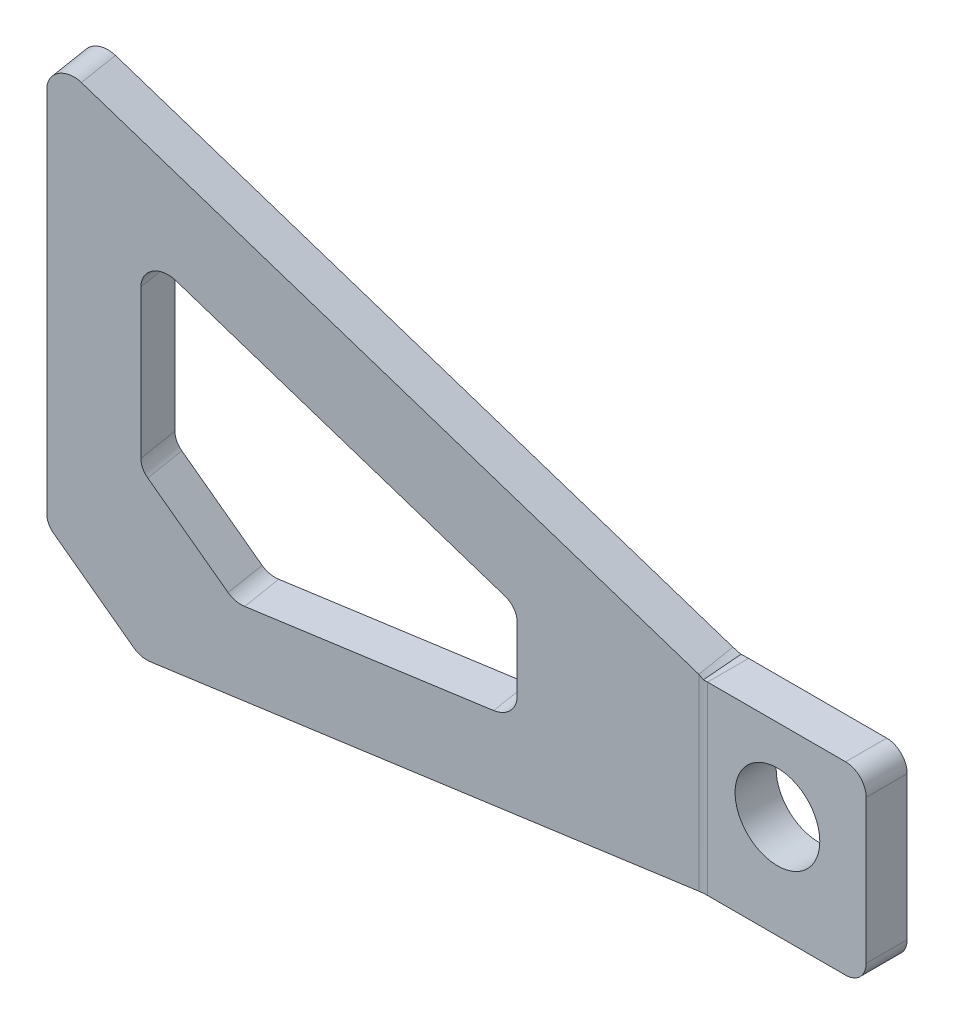
ISO-10303-21;
HEADER;
FILE_DESCRIPTION(('STEP AP214'),'2;1');
FILE_NAME('part.step','',(''),(''),'','','');
FILE_SCHEMA(('AUTOMOTIVE_DESIGN { 1 0 10303 214 1 1 1 1 }'));
ENDSEC;
DATA;
#1=APPLICATION_CONTEXT('core data for automotive mechanical design processes');
#2=APPLICATION_PROTOCOL_DEFINITION('international standard','automotive_design',2000,#1);
#3=PRODUCT_CONTEXT('',#1,'mechanical');
#4=PRODUCT('Part','Part','',(#3));
#5=PRODUCT_RELATED_PRODUCT_CATEGORY('part','',(#4));
#6=PRODUCT_DEFINITION_FORMATION('','',#4);
#7=PRODUCT_DEFINITION_CONTEXT('part definition',#1,'design');
#8=PRODUCT_DEFINITION('design','',#6,#7);
#9=PRODUCT_DEFINITION_SHAPE('','',#8);
#10=(LENGTH_UNIT() NAMED_UNIT(*) SI_UNIT(.MILLI.,.METRE.));
#11=(NAMED_UNIT(*) PLANE_ANGLE_UNIT() SI_UNIT($,.RADIAN.));
#12=(NAMED_UNIT(*) SI_UNIT($,.STERADIAN.) SOLID_ANGLE_UNIT());
#13=UNCERTAINTY_MEASURE_WITH_UNIT(LENGTH_MEASURE(1.E-05),#10,'distance_accuracy_value','');
#14=(GEOMETRIC_REPRESENTATION_CONTEXT(3) GLOBAL_UNCERTAINTY_ASSIGNED_CONTEXT((#13)) GLOBAL_UNIT_ASSIGNED_CONTEXT((#10,
#11,#12)) REPRESENTATION_CONTEXT('',''));
#15=CARTESIAN_POINT('',(0.,0.,0.));
#16=DIRECTION('',(0.,0.,1.));
#17=DIRECTION('',(1.,0.,0.));
#18=AXIS2_PLACEMENT_3D('',#15,#16,#17);
#19=CARTESIAN_POINT('',(0.609276448916205,76.2,7.71968790551372));
#20=DIRECTION('',(0.466303984354861,0.881479970028782,-0.0745228596662755));
#21=DIRECTION('',(-0.870434104129073,0.472221412515419,0.139109338043714));
#22=AXIS2_PLACEMENT_3D('',#19,#20,#21);
#23=PLANE('',#22);
#24=DIRECTION('',(-0.870434104129073,0.472221412515419,0.139109338043714));
#25=VECTOR('',#24,1.);
#26=CARTESIAN_POINT('',(0.609276448916205,76.2,7.71968790551372));
#27=LINE('',#26,#25);
#28=CARTESIAN_POINT('',(87.5247750487067,29.0472525104682,-6.17080353846967));
#29=VERTEX_POINT('',#28);
#30=CARTESIAN_POINT('',(5.22500552874326,73.6959091153198,6.9820203281084));
#31=VERTEX_POINT('',#30);
#32=EDGE_CURVE('E256',#29,#31,#27,.T.);
#33=ORIENTED_EDGE('',*,*,#32,.T.);
#34=DIRECTION('',(0.157813385185794,0.,0.987468954173345));
#35=VECTOR('',#34,1.);
#36=CARTESIAN_POINT('',(5.22500552874326,73.6959091153198,6.9820203281084));
#37=LINE('',#36,#35);
#38=CARTESIAN_POINT('',(6.22712052467305,73.6959091153198,13.2524481871091));
#39=VERTEX_POINT('',#38);
#40=EDGE_CURVE('E398',#31,#39,#37,.T.);
#41=ORIENTED_EDGE('',*,*,#40,.T.);
#42=DIRECTION('',(-0.870434104129073,0.472221412515419,0.139109338043714));
#43=VECTOR('',#42,1.);
#44=CARTESIAN_POINT('',(1.611391444846,76.2,13.9901157645145));
#45=LINE('',#44,#43);
#46=CARTESIAN_POINT('',(88.5268900446365,29.0472525104682,0.0996243205310717));
#47=VERTEX_POINT('',#46);
#48=EDGE_CURVE('E271',#47,#39,#45,.T.);
#49=ORIENTED_EDGE('',*,*,#48,.F.);
#50=CARTESIAN_POINT('',(87.5247750487067,29.0472525104682,-6.17080353846967));
#51=CARTESIAN_POINT('',(88.5268900446365,29.0472525104682,0.0996243205310717));
#52=B_SPLINE_CURVE_WITH_KNOTS('',1,(#50,#51),.UNSPECIFIED.,.F.,.F.,(2,2),(0.,1.),.UNSPECIFIED.);
#53=EDGE_CURVE('E238',#47,#29,#52,.F.);
#54=ORIENTED_EDGE('',*,*,#53,.T.);
#55=EDGE_LOOP('',(#33,#41,#49,#54));
#56=FACE_BOUND('',#55,.T.);
#57=ADVANCED_FACE('F55',(#56),#23,.T.);
#58=CARTESIAN_POINT('',(113.47697791093,0.,-10.3183820212225));
#59=DIRECTION('',(0.,-1.,0.));
#60=DIRECTION('',(0.987468954173345,0.,-0.157813385185794));
#61=AXIS2_PLACEMENT_3D('',#58,#59,#60);
#62=PLANE('',#61);
#63=DIRECTION('',(0.987468954173345,0.,-0.157813385185794));
#64=VECTOR('',#63,1.);
#65=CARTESIAN_POINT('',(114.479092906859,0.,-4.04795416222179));
#66=LINE('',#65,#64);
#67=CARTESIAN_POINT('',(15.4508952933876,0.,11.7783409614691));
#68=VERTEX_POINT('',#67);
#69=CARTESIAN_POINT('',(88.5268900446365,0.,0.0996243205310717));
#70=VERTEX_POINT('',#69);
#71=EDGE_CURVE('E266',#68,#70,#66,.T.);
#72=ORIENTED_EDGE('',*,*,#71,.F.);
#73=DIRECTION('',(0.157813385185794,0.,0.987468954173345));
#74=VECTOR('',#73,1.);
#75=CARTESIAN_POINT('',(14.4487802974578,0.,5.50791310246833));
#76=LINE('',#75,#74);
#77=CARTESIAN_POINT('',(14.4487802974578,0.,5.50791310246834));
#78=VERTEX_POINT('',#77);
#79=EDGE_CURVE('E416',#68,#78,#76,.F.);
#80=ORIENTED_EDGE('',*,*,#79,.T.);
#81=DIRECTION('',(0.987468954173345,0.,-0.157813385185794));
#82=VECTOR('',#81,1.);
#83=CARTESIAN_POINT('',(113.47697791093,0.,-10.3183820212225));
#84=LINE('',#83,#82);
#85=CARTESIAN_POINT('',(87.5247750487067,0.,-6.17080353846967));
#86=VERTEX_POINT('',#85);
#87=EDGE_CURVE('E239',#78,#86,#84,.T.);
#88=ORIENTED_EDGE('',*,*,#87,.T.);
#89=DIRECTION('',(0.157813385185794,0.,0.987468954173345));
#90=VECTOR('',#89,1.);
#91=CARTESIAN_POINT('',(87.5247750487067,0.,-6.17080353846967));
#92=LINE('',#91,#90);
#93=EDGE_CURVE('E449',#86,#70,#92,.T.);
#94=ORIENTED_EDGE('',*,*,#93,.T.);
#95=EDGE_LOOP('',(#72,#80,#88,#94));
#96=FACE_BOUND('',#95,.T.);
#97=ADVANCED_FACE('F291',(#96),#62,.T.);
#98=CARTESIAN_POINT('',(0.609276448916205,0.,7.71968790551372));
#99=DIRECTION('',(-0.157813385185794,0.,-0.987468954173345));
#100=DIRECTION('',(-0.987468954173345,0.,0.157813385185794));
#101=AXIS2_PLACEMENT_3D('',#98,#99,#100);
#102=PLANE('',#101);
#103=DIRECTION('',(-0.870434104129073,0.472221412515419,0.139109338043714));
#104=VECTOR('',#103,1.);
#105=CARTESIAN_POINT('',(13.1501321669177,54.9888408419135,5.71545791365413));
#106=LINE('',#105,#104);
#107=CARTESIAN_POINT('',(61.6588562597499,28.6722499572333,-2.03701463525973));
#108=VERTEX_POINT('',#107);
#109=CARTESIAN_POINT('',(17.7658612467447,52.4847499572332,4.97779033624881));
#110=VERTEX_POINT('',#109);
#111=EDGE_CURVE('E471',#108,#110,#106,.T.);
#112=ORIENTED_EDGE('',*,*,#111,.T.);
#113=CARTESIAN_POINT('',(16.2853460964181,49.6860510523919,5.21440041568924));
#114=DIRECTION('',(-0.157813385185794,0.,-0.987468954173345));
#115=DIRECTION('',(-0.987468954173345,0.,0.157813385185794));
#116=AXIS2_PLACEMENT_3D('',#113,#114,#115);
#117=CIRCLE('',#116,3.175);
#118=CARTESIAN_POINT('',(13.1501321669177,49.6860510523919,5.71545791365413));
#119=VERTEX_POINT('',#118);
#120=EDGE_CURVE('E362',#110,#119,#117,.F.);
#121=ORIENTED_EDGE('',*,*,#120,.T.);
#122=DIRECTION('',(0.,-1.,0.));
#123=VECTOR('',#122,1.);
#124=CARTESIAN_POINT('',(13.1501321669177,12.7,5.71545791365413));
#125=LINE('',#124,#123);
#126=CARTESIAN_POINT('',(13.1501321669177,26.7151280605345,5.71545791365413));
#127=VERTEX_POINT('',#126);
#128=EDGE_CURVE('E469',#119,#127,#125,.T.);
#129=ORIENTED_EDGE('',*,*,#128,.T.);
#130=CARTESIAN_POINT('',(16.2853460964181,26.7151280605345,5.21440041568924));
#131=DIRECTION('',(-0.157813385185794,0.,-0.987468954173345));
#132=DIRECTION('',(-0.987468954173345,0.,0.157813385185794));
#133=AXIS2_PLACEMENT_3D('',#130,#131,#132);
#134=CIRCLE('',#133,3.175);
#135=CARTESIAN_POINT('',(14.0684150663978,24.4700640302672,5.56870157026458));
#136=VERTEX_POINT('',#135);
#137=EDGE_CURVE('E360',#127,#136,#134,.F.);
#138=ORIENTED_EDGE('',*,*,#137,.T.);
#139=DIRECTION('',(-0.698245993707164,0.707106781186544,0.11159091482688));
#140=VECTOR('',#139,1.);
#141=CARTESIAN_POINT('',(25.6909878849193,12.7,3.71122792179453));
#142=LINE('',#141,#140);
#143=CARTESIAN_POINT('',(24.7727049854391,13.6299359697327,3.85798426518409));
#144=VERTEX_POINT('',#143);
#145=EDGE_CURVE('E439',#136,#144,#142,.F.);
#146=ORIENTED_EDGE('',*,*,#145,.T.);
#147=CARTESIAN_POINT('',(26.9896360154594,15.875,3.50368311060875));
#148=DIRECTION('',(-0.157813385185794,0.,-0.987468954173345));
#149=DIRECTION('',(-0.987468954173345,0.,0.157813385185794));
#150=AXIS2_PLACEMENT_3D('',#147,#148,#149);
#151=CIRCLE('',#150,3.175);
#152=CARTESIAN_POINT('',(26.9896360154594,12.7,3.50368311060874));
#153=VERTEX_POINT('',#152);
#154=EDGE_CURVE('E12',#144,#153,#151,.F.);
#155=ORIENTED_EDGE('',*,*,#154,.T.);
#156=DIRECTION('',(0.987468954173345,0.,-0.157813385185794));
#157=VECTOR('',#156,1.);
#158=CARTESIAN_POINT('',(63.3135550389236,12.7,-2.3014620537842));
#159=LINE('',#158,#157);
#160=CARTESIAN_POINT('',(60.1783411094232,12.7,-1.8004045558193));
#161=VERTEX_POINT('',#160);
#162=EDGE_CURVE('E491',#153,#161,#159,.T.);
#163=ORIENTED_EDGE('',*,*,#162,.T.);
#164=CARTESIAN_POINT('',(60.1783411094232,15.875,-1.8004045558193));
#165=DIRECTION('',(-0.157813385185794,0.,-0.987468954173345));
#166=DIRECTION('',(-0.987468954173345,0.,0.157813385185794));
#167=AXIS2_PLACEMENT_3D('',#164,#165,#166);
#168=CIRCLE('',#167,3.175);
#169=CARTESIAN_POINT('',(63.3135550389236,15.875,-2.3014620537842));
#170=VERTEX_POINT('',#169);
#171=EDGE_CURVE('E372',#161,#170,#168,.F.);
#172=ORIENTED_EDGE('',*,*,#171,.T.);
#173=DIRECTION('',(0.,1.,0.));
#174=VECTOR('',#173,1.);
#175=CARTESIAN_POINT('',(63.3135550389236,27.7745551276278,-2.3014620537842));
#176=LINE('',#175,#174);
#177=CARTESIAN_POINT('',(63.3135550389236,25.8735510523919,-2.3014620537842));
#178=VERTEX_POINT('',#177);
#179=EDGE_CURVE('E476',#170,#178,#176,.T.);
#180=ORIENTED_EDGE('',*,*,#179,.T.);
#181=CARTESIAN_POINT('',(60.1783411094232,25.8735510523919,-1.8004045558193));
#182=DIRECTION('',(-0.157813385185794,0.,-0.987468954173345));
#183=DIRECTION('',(-0.987468954173345,0.,0.157813385185794));
#184=AXIS2_PLACEMENT_3D('',#181,#182,#183);
#185=CIRCLE('',#184,3.175);
#186=EDGE_CURVE('E368',#178,#108,#185,.F.);
#187=ORIENTED_EDGE('',*,*,#186,.T.);
#188=EDGE_LOOP('',(#112,#121,#129,#138,#146,#155,#163,#172,#180,#187));
#189=FACE_BOUND('',#188,.T.);
#190=DIRECTION('',(0.698245993707162,-0.707106781186547,-0.11159091482688));
#191=VECTOR('',#190,1.);
#192=CARTESIAN_POINT('',(6.87970430791694,6.35000000000001,6.71757290958393));
#193=LINE('',#192,#191);
#194=CARTESIAN_POINT('',(12.2318492674376,0.929935969732703,5.86221425704368));
#195=VERTEX_POINT('',#194);
#196=CARTESIAN_POINT('',(1.52755934839634,11.7700640302673,7.57293156212416));
#197=VERTEX_POINT('',#196);
#198=EDGE_CURVE('E444',#195,#197,#193,.F.);
#199=ORIENTED_EDGE('',*,*,#198,.T.);
#200=CARTESIAN_POINT('',(3.74449037841658,14.0151280605346,7.21863040754882));
#201=DIRECTION('',(-0.157813385185794,0.,-0.987468954173345));
#202=DIRECTION('',(-0.987468954173345,0.,0.157813385185794));
#203=AXIS2_PLACEMENT_3D('',#200,#201,#202);
#204=CIRCLE('',#203,3.175);
#205=CARTESIAN_POINT('',(0.609276448916205,14.0151280605346,7.71968790551372));
#206=VERTEX_POINT('',#205);
#207=EDGE_CURVE('E419',#197,#206,#204,.T.);
#208=ORIENTED_EDGE('',*,*,#207,.T.);
#209=DIRECTION('',(0.,-1.,0.));
#210=VECTOR('',#209,1.);
#211=CARTESIAN_POINT('',(0.609276448916205,0.,7.71968790551372));
#212=LINE('',#211,#210);
#213=CARTESIAN_POINT('',(0.609276448916205,70.8972102104783,7.71968790551372));
#214=VERTEX_POINT('',#213);
#215=EDGE_CURVE('E265',#214,#206,#212,.T.);
#216=ORIENTED_EDGE('',*,*,#215,.F.);
#217=CARTESIAN_POINT('',(3.74449037841658,70.8972102104784,7.21863040754882));
#218=DIRECTION('',(-0.157813385185794,0.,-0.987468954173345));
#219=DIRECTION('',(-0.987468954173345,0.,0.157813385185794));
#220=AXIS2_PLACEMENT_3D('',#217,#218,#219);
#221=CIRCLE('',#220,3.175);
#222=EDGE_CURVE('E261',#214,#31,#221,.T.);
#223=ORIENTED_EDGE('',*,*,#222,.T.);
#224=ORIENTED_EDGE('',*,*,#32,.F.);
#225=DIRECTION('',(0.,-1.,0.));
#226=VECTOR('',#225,1.);
#227=CARTESIAN_POINT('',(87.5247750487067,0.,-6.17080353846967));
#228=LINE('',#227,#226);
#229=EDGE_CURVE('E224',#29,#86,#228,.T.);
#230=ORIENTED_EDGE('',*,*,#229,.T.);
#231=ORIENTED_EDGE('',*,*,#87,.F.);
#232=CARTESIAN_POINT('',(14.4487802974578,3.175,5.50791310246834));
#233=DIRECTION('',(-0.157813385185794,0.,-0.987468954173345));
#234=DIRECTION('',(-0.987468954173345,0.,0.157813385185794));
#235=AXIS2_PLACEMENT_3D('',#232,#233,#234);
#236=CIRCLE('',#235,3.175);
#237=EDGE_CURVE('E421',#78,#195,#236,.T.);
#238=ORIENTED_EDGE('',*,*,#237,.T.);
#239=EDGE_LOOP('',(#199,#208,#216,#223,#224,#230,#231,#238));
#240=FACE_BOUND('',#239,.T.);
#241=ADVANCED_FACE('F258',(#189,#240),#102,.T.);
#242=CARTESIAN_POINT('',(0.609276448916205,0.,7.71968790551372));
#243=DIRECTION('',(-0.987468954173345,0.,0.157813385185794));
#244=DIRECTION('',(0.157813385185794,0.,0.987468954173345));
#245=AXIS2_PLACEMENT_3D('',#242,#243,#244);
#246=PLANE('',#245);
#247=ORIENTED_EDGE('',*,*,#215,.T.);
#248=DIRECTION('',(-0.157813385185794,0.,-0.987468954173345));
#249=VECTOR('',#248,1.);
#250=CARTESIAN_POINT('',(0.609276448916205,14.0151280605346,7.71968790551372));
#251=LINE('',#250,#249);
#252=CARTESIAN_POINT('',(1.611391444846,14.0151280605346,13.9901157645145));
#253=VERTEX_POINT('',#252);
#254=EDGE_CURVE('E434',#206,#253,#251,.F.);
#255=ORIENTED_EDGE('',*,*,#254,.T.);
#256=DIRECTION('',(0.,-1.,0.));
#257=VECTOR('',#256,1.);
#258=CARTESIAN_POINT('',(1.611391444846,0.,13.9901157645145));
#259=LINE('',#258,#257);
#260=CARTESIAN_POINT('',(1.611391444846,70.8972102104783,13.9901157645145));
#261=VERTEX_POINT('',#260);
#262=EDGE_CURVE('E462',#261,#253,#259,.T.);
#263=ORIENTED_EDGE('',*,*,#262,.F.);
#264=DIRECTION('',(0.157813385185794,0.,0.987468954173345));
#265=VECTOR('',#264,1.);
#266=CARTESIAN_POINT('',(0.609276448916205,70.8972102104784,7.71968790551372));
#267=LINE('',#266,#265);
#268=EDGE_CURVE('E437',#261,#214,#267,.F.);
#269=ORIENTED_EDGE('',*,*,#268,.T.);
#270=EDGE_LOOP('',(#247,#255,#263,#269));
#271=FACE_BOUND('',#270,.T.);
#272=ADVANCED_FACE('F297',(#271),#246,.T.);
#273=CARTESIAN_POINT('',(1.611391444846,0.,13.9901157645145));
#274=DIRECTION('',(-0.157813385185794,0.,-0.987468954173345));
#275=DIRECTION('',(-0.987468954173345,0.,0.157813385185794));
#276=AXIS2_PLACEMENT_3D('',#273,#274,#275);
#277=PLANE('',#276);
#278=ORIENTED_EDGE('',*,*,#262,.T.);
#279=CARTESIAN_POINT('',(4.74660537434637,14.0151280605346,13.4890582665496));
#280=DIRECTION('',(-0.157813385185794,0.,-0.987468954173345));
#281=DIRECTION('',(-0.987468954173345,0.,0.157813385185794));
#282=AXIS2_PLACEMENT_3D('',#279,#280,#281);
#283=CIRCLE('',#282,3.175);
#284=CARTESIAN_POINT('',(2.52967434432613,11.7700640302673,13.8433594211249));
#285=VERTEX_POINT('',#284);
#286=EDGE_CURVE('E428',#253,#285,#283,.F.);
#287=ORIENTED_EDGE('',*,*,#286,.T.);
#288=DIRECTION('',(-0.698245993707162,0.707106781186547,0.11159091482688));
#289=VECTOR('',#288,1.);
#290=CARTESIAN_POINT('',(1.611391444846,12.7,13.9901157645145));
#291=LINE('',#290,#289);
#292=CARTESIAN_POINT('',(13.2339642633674,0.929935969732702,12.1326421160444));
#293=VERTEX_POINT('',#292);
#294=EDGE_CURVE('E446',#285,#293,#291,.F.);
#295=ORIENTED_EDGE('',*,*,#294,.T.);
#296=CARTESIAN_POINT('',(15.4508952933876,3.175,11.7783409614691));
#297=DIRECTION('',(-0.157813385185794,0.,-0.987468954173345));
#298=DIRECTION('',(-0.987468954173345,0.,0.157813385185794));
#299=AXIS2_PLACEMENT_3D('',#296,#297,#298);
#300=CIRCLE('',#299,3.175);
#301=EDGE_CURVE('E430',#293,#68,#300,.F.);
#302=ORIENTED_EDGE('',*,*,#301,.T.);
#303=ORIENTED_EDGE('',*,*,#71,.T.);
#304=DIRECTION('',(0.,-1.,0.));
#305=VECTOR('',#304,1.);
#306=CARTESIAN_POINT('',(88.5268900446365,0.,0.0996243205310682));
#307=LINE('',#306,#305);
#308=EDGE_CURVE('E273',#47,#70,#307,.T.);
#309=ORIENTED_EDGE('',*,*,#308,.F.);
#310=ORIENTED_EDGE('',*,*,#48,.T.);
#311=CARTESIAN_POINT('',(4.74660537434637,70.8972102104784,13.4890582665496));
#312=DIRECTION('',(-0.157813385185794,0.,-0.987468954173345));
#313=DIRECTION('',(-0.987468954173345,0.,0.157813385185794));
#314=AXIS2_PLACEMENT_3D('',#311,#312,#313);
#315=CIRCLE('',#314,3.175);
#316=EDGE_CURVE('E432',#39,#261,#315,.F.);
#317=ORIENTED_EDGE('',*,*,#316,.T.);
#318=EDGE_LOOP('',(#278,#287,#295,#302,#303,#309,#310,#317));
#319=FACE_BOUND('',#318,.T.);
#320=DIRECTION('',(0.,1.,0.));
#321=VECTOR('',#320,1.);
#322=CARTESIAN_POINT('',(64.3156700348534,27.7745551276278,3.96896580521654));
#323=LINE('',#322,#321);
#324=CARTESIAN_POINT('',(64.3156700348534,15.875,3.96896580521654));
#325=VERTEX_POINT('',#324);
#326=CARTESIAN_POINT('',(64.3156700348534,25.8735510523919,3.96896580521654));
#327=VERTEX_POINT('',#326);
#328=EDGE_CURVE('E483',#325,#327,#323,.T.);
#329=ORIENTED_EDGE('',*,*,#328,.F.);
#330=CARTESIAN_POINT('',(61.180456105353,15.875,4.47002330318144));
#331=DIRECTION('',(-0.157813385185794,0.,-0.987468954173345));
#332=DIRECTION('',(-0.987468954173345,0.,0.157813385185794));
#333=AXIS2_PLACEMENT_3D('',#330,#331,#332);
#334=CIRCLE('',#333,3.175);
#335=CARTESIAN_POINT('',(61.180456105353,12.7,4.47002330318144));
#336=VERTEX_POINT('',#335);
#337=EDGE_CURVE('E374',#325,#336,#334,.T.);
#338=ORIENTED_EDGE('',*,*,#337,.T.);
#339=DIRECTION('',(0.987468954173345,0.,-0.157813385185794));
#340=VECTOR('',#339,1.);
#341=CARTESIAN_POINT('',(64.3156700348534,12.7,3.96896580521654));
#342=LINE('',#341,#340);
#343=CARTESIAN_POINT('',(27.9917510113891,12.7,9.77411096960949));
#344=VERTEX_POINT('',#343);
#345=EDGE_CURVE('E480',#344,#336,#342,.T.);
#346=ORIENTED_EDGE('',*,*,#345,.F.);
#347=CARTESIAN_POINT('',(27.9917510113891,15.875,9.77411096960949));
#348=DIRECTION('',(-0.157813385185794,0.,-0.987468954173345));
#349=DIRECTION('',(-0.987468954173345,0.,0.157813385185794));
#350=AXIS2_PLACEMENT_3D('',#347,#348,#349);
#351=CIRCLE('',#350,3.175);
#352=CARTESIAN_POINT('',(25.7748199813689,13.6299359697327,10.1284121241848));
#353=VERTEX_POINT('',#352);
#354=EDGE_CURVE('E63',#344,#353,#351,.T.);
#355=ORIENTED_EDGE('',*,*,#354,.T.);
#356=DIRECTION('',(0.698245993707164,-0.707106781186544,-0.11159091482688));
#357=VECTOR('',#356,1.);
#358=CARTESIAN_POINT('',(20.4226750218481,19.0500000000001,10.9837707767251));
#359=LINE('',#358,#357);
#360=CARTESIAN_POINT('',(15.0705300623276,24.4700640302672,11.8391294292653));
#361=VERTEX_POINT('',#360);
#362=EDGE_CURVE('E442',#353,#361,#359,.F.);
#363=ORIENTED_EDGE('',*,*,#362,.T.);
#364=CARTESIAN_POINT('',(17.2874610923479,26.7151280605345,11.48482827469));
#365=DIRECTION('',(-0.157813385185794,0.,-0.987468954173345));
#366=DIRECTION('',(-0.987468954173345,0.,0.157813385185794));
#367=AXIS2_PLACEMENT_3D('',#364,#365,#366);
#368=CIRCLE('',#367,3.175);
#369=CARTESIAN_POINT('',(14.1522471628475,26.7151280605345,11.9858857726549));
#370=VERTEX_POINT('',#369);
#371=EDGE_CURVE('E352',#361,#370,#368,.T.);
#372=ORIENTED_EDGE('',*,*,#371,.T.);
#373=DIRECTION('',(0.,-1.,0.));
#374=VECTOR('',#373,1.);
#375=CARTESIAN_POINT('',(14.1522471628475,12.7,11.9858857726549));
#376=LINE('',#375,#374);
#377=CARTESIAN_POINT('',(14.1522471628475,49.6860510523919,11.9858857726549));
#378=VERTEX_POINT('',#377);
#379=EDGE_CURVE('E490',#378,#370,#376,.T.);
#380=ORIENTED_EDGE('',*,*,#379,.F.);
#381=CARTESIAN_POINT('',(17.2874610923479,49.6860510523919,11.48482827469));
#382=DIRECTION('',(-0.157813385185794,0.,-0.987468954173345));
#383=DIRECTION('',(-0.987468954173345,0.,0.157813385185794));
#384=AXIS2_PLACEMENT_3D('',#381,#382,#383);
#385=CIRCLE('',#384,3.175);
#386=CARTESIAN_POINT('',(18.7679762426745,52.4847499572332,11.2482181952496));
#387=VERTEX_POINT('',#386);
#388=EDGE_CURVE('E366',#378,#387,#385,.T.);
#389=ORIENTED_EDGE('',*,*,#388,.T.);
#390=DIRECTION('',(-0.870434104129073,0.472221412515419,0.139109338043714));
#391=VECTOR('',#390,1.);
#392=CARTESIAN_POINT('',(14.1522471628475,54.9888408419135,11.9858857726549));
#393=LINE('',#392,#391);
#394=CARTESIAN_POINT('',(62.6609712556797,28.6722499572333,4.23341322374102));
#395=VERTEX_POINT('',#394);
#396=EDGE_CURVE('E487',#395,#387,#393,.T.);
#397=ORIENTED_EDGE('',*,*,#396,.F.);
#398=CARTESIAN_POINT('',(61.180456105353,25.8735510523919,4.47002330318144));
#399=DIRECTION('',(-0.157813385185794,0.,-0.987468954173345));
#400=DIRECTION('',(-0.987468954173345,0.,0.157813385185794));
#401=AXIS2_PLACEMENT_3D('',#398,#399,#400);
#402=CIRCLE('',#401,3.175);
#403=EDGE_CURVE('E370',#395,#327,#402,.T.);
#404=ORIENTED_EDGE('',*,*,#403,.T.);
#405=EDGE_LOOP('',(#329,#338,#346,#355,#363,#372,#380,#389,#397,#404));
#406=FACE_BOUND('',#405,.T.);
#407=ADVANCED_FACE('F293',(#319,#406),#277,.F.);
#408=CARTESIAN_POINT('',(63.3135550389236,12.7,-2.3014620537842));
#409=DIRECTION('',(0.,-1.,0.));
#410=DIRECTION('',(0.987468954173345,0.,-0.157813385185794));
#411=AXIS2_PLACEMENT_3D('',#408,#409,#410);
#412=PLANE('',#411);
#413=ORIENTED_EDGE('',*,*,#345,.T.);
#414=DIRECTION('',(0.157813385185794,0.,0.987468954173345));
#415=VECTOR('',#414,1.);
#416=CARTESIAN_POINT('',(60.1783411094232,12.7,-1.8004045558193));
#417=LINE('',#416,#415);
#418=EDGE_CURVE('E388',#336,#161,#417,.F.);
#419=ORIENTED_EDGE('',*,*,#418,.T.);
#420=ORIENTED_EDGE('',*,*,#162,.F.);
#421=DIRECTION('',(-0.157813385185794,0.,-0.987468954173345));
#422=VECTOR('',#421,1.);
#423=CARTESIAN_POINT('',(27.9917510113891,12.7,9.77411096960949));
#424=LINE('',#423,#422);
#425=EDGE_CURVE('E390',#153,#344,#424,.F.);
#426=ORIENTED_EDGE('',*,*,#425,.T.);
#427=EDGE_LOOP('',(#413,#419,#420,#426));
#428=FACE_BOUND('',#427,.T.);
#429=ADVANCED_FACE('F296',(#428),#412,.F.);
#430=CARTESIAN_POINT('',(13.1501321669177,12.7,5.71545791365413));
#431=DIRECTION('',(-0.987468954173345,0.,0.157813385185794));
#432=DIRECTION('',(0.,-1.,0.));
#433=AXIS2_PLACEMENT_3D('',#430,#431,#432);
#434=PLANE('',#433);
#435=ORIENTED_EDGE('',*,*,#128,.F.);
#436=DIRECTION('',(0.157813385185794,0.,0.987468954173345));
#437=VECTOR('',#436,1.);
#438=CARTESIAN_POINT('',(14.1522471628475,49.6860510523919,11.9858857726549));
#439=LINE('',#438,#437);
#440=EDGE_CURVE('E379',#119,#378,#439,.T.);
#441=ORIENTED_EDGE('',*,*,#440,.T.);
#442=ORIENTED_EDGE('',*,*,#379,.T.);
#443=DIRECTION('',(0.157813385185794,0.,0.987468954173345));
#444=VECTOR('',#443,1.);
#445=CARTESIAN_POINT('',(13.1501321669177,26.7151280605345,5.71545791365413));
#446=LINE('',#445,#444);
#447=EDGE_CURVE('E355',#370,#127,#446,.F.);
#448=ORIENTED_EDGE('',*,*,#447,.T.);
#449=EDGE_LOOP('',(#435,#441,#442,#448));
#450=FACE_BOUND('',#449,.T.);
#451=ADVANCED_FACE('F521',(#450),#434,.F.);
#452=CARTESIAN_POINT('',(13.1501321669177,54.9888408419135,5.71545791365413));
#453=DIRECTION('',(0.466303984354861,0.881479970028782,-0.0745228596662755));
#454=DIRECTION('',(-0.870434104129073,0.472221412515419,0.139109338043714));
#455=AXIS2_PLACEMENT_3D('',#452,#453,#454);
#456=PLANE('',#455);
#457=ORIENTED_EDGE('',*,*,#111,.F.);
#458=DIRECTION('',(0.157813385185794,0.,0.987468954173345));
#459=VECTOR('',#458,1.);
#460=CARTESIAN_POINT('',(62.6609712556797,28.6722499572333,4.23341322374101));
#461=LINE('',#460,#459);
#462=EDGE_CURVE('E383',#108,#395,#461,.T.);
#463=ORIENTED_EDGE('',*,*,#462,.T.);
#464=ORIENTED_EDGE('',*,*,#396,.T.);
#465=DIRECTION('',(0.157813385185794,0.,0.987468954173345));
#466=VECTOR('',#465,1.);
#467=CARTESIAN_POINT('',(17.7658612467447,52.4847499572332,4.97779033624881));
#468=LINE('',#467,#466);
#469=EDGE_CURVE('E386',#387,#110,#468,.F.);
#470=ORIENTED_EDGE('',*,*,#469,.T.);
#471=EDGE_LOOP('',(#457,#463,#464,#470));
#472=FACE_BOUND('',#471,.T.);
#473=ADVANCED_FACE('F517',(#472),#456,.F.);
#474=CARTESIAN_POINT('',(63.3135550389236,27.7745551276278,-2.3014620537842));
#475=DIRECTION('',(0.987468954173345,0.,-0.157813385185794));
#476=DIRECTION('',(-0.157813385185794,0.,-0.987468954173345));
#477=AXIS2_PLACEMENT_3D('',#474,#475,#476);
#478=PLANE('',#477);
#479=ORIENTED_EDGE('',*,*,#179,.F.);
#480=DIRECTION('',(0.157813385185794,0.,0.987468954173345));
#481=VECTOR('',#480,1.);
#482=CARTESIAN_POINT('',(64.3156700348534,15.875,3.96896580521655));
#483=LINE('',#482,#481);
#484=EDGE_CURVE('E393',#170,#325,#483,.T.);
#485=ORIENTED_EDGE('',*,*,#484,.T.);
#486=ORIENTED_EDGE('',*,*,#328,.T.);
#487=DIRECTION('',(0.157813385185794,0.,0.987468954173345));
#488=VECTOR('',#487,1.);
#489=CARTESIAN_POINT('',(63.3135550389236,25.8735510523919,-2.3014620537842));
#490=LINE('',#489,#488);
#491=EDGE_CURVE('E396',#327,#178,#490,.F.);
#492=ORIENTED_EDGE('',*,*,#491,.T.);
#493=EDGE_LOOP('',(#479,#485,#486,#492));
#494=FACE_BOUND('',#493,.T.);
#495=ADVANCED_FACE('F509',(#494),#478,.F.);
#496=CARTESIAN_POINT('',(114.3,28.575,-6.35));
#497=DIRECTION('',(1.,0.,0.));
#498=DIRECTION('',(0.,0.,-1.));
#499=AXIS2_PLACEMENT_3D('',#496,#497,#498);
#500=PLANE('',#499);
#501=DIRECTION('',(0.,1.,0.));
#502=VECTOR('',#501,1.);
#503=CARTESIAN_POINT('',(114.3,28.575,0.));
#504=LINE('',#503,#502);
#505=CARTESIAN_POINT('',(114.3,3.175,0.));
#506=VERTEX_POINT('',#505);
#507=CARTESIAN_POINT('',(114.3,25.4,0.));
#508=VERTEX_POINT('',#507);
#509=EDGE_CURVE('E730',#506,#508,#504,.T.);
#510=ORIENTED_EDGE('',*,*,#509,.F.);
#511=DIRECTION('',(0.,0.,1.));
#512=VECTOR('',#511,1.);
#513=CARTESIAN_POINT('',(114.3,3.175,-6.35));
#514=LINE('',#513,#512);
#515=CARTESIAN_POINT('',(114.3,3.175,-6.35));
#516=VERTEX_POINT('',#515);
#517=EDGE_CURVE('E404',#506,#516,#514,.F.);
#518=ORIENTED_EDGE('',*,*,#517,.T.);
#519=DIRECTION('',(0.,1.,0.));
#520=VECTOR('',#519,1.);
#521=CARTESIAN_POINT('',(114.3,28.575,-6.35));
#522=LINE('',#521,#520);
#523=CARTESIAN_POINT('',(114.3,25.4,-6.35));
#524=VERTEX_POINT('',#523);
#525=EDGE_CURVE('E750',#516,#524,#522,.T.);
#526=ORIENTED_EDGE('',*,*,#525,.T.);
#527=DIRECTION('',(0.,0.,1.));
#528=VECTOR('',#527,1.);
#529=CARTESIAN_POINT('',(114.3,25.4,-6.35));
#530=LINE('',#529,#528);
#531=EDGE_CURVE('E406',#524,#508,#530,.T.);
#532=ORIENTED_EDGE('',*,*,#531,.T.);
#533=EDGE_LOOP('',(#510,#518,#526,#532));
#534=FACE_BOUND('',#533,.T.);
#535=ADVANCED_FACE('F536',(#534),#500,.T.);
#536=CARTESIAN_POINT('',(0.,0.,-6.35));
#537=DIRECTION('',(0.,0.,-1.));
#538=DIRECTION('',(-1.,0.,0.));
#539=AXIS2_PLACEMENT_3D('',#536,#537,#538);
#540=PLANE('',#539);
#541=CARTESIAN_POINT('',(100.584,15.9258,-6.35));
#542=DIRECTION('',(0.,0.,-1.));
#543=DIRECTION('',(-1.,0.,0.));
#544=AXIS2_PLACEMENT_3D('',#541,#542,#543);
#545=CIRCLE('',#544,6.5484375);
#546=CARTESIAN_POINT('',(94.0355625,15.9258,-6.35));
#547=VERTEX_POINT('',#546);
#548=EDGE_CURVE('E771',#547,#547,#545,.T.);
#549=ORIENTED_EDGE('',*,*,#548,.F.);
#550=EDGE_LOOP('',(#549));
#551=FACE_BOUND('',#550,.T.);
#552=ORIENTED_EDGE('',*,*,#525,.F.);
#553=CARTESIAN_POINT('',(111.125,3.175,-6.35));
#554=DIRECTION('',(0.,0.,-1.));
#555=DIRECTION('',(-1.,0.,0.));
#556=AXIS2_PLACEMENT_3D('',#553,#554,#555);
#557=CIRCLE('',#556,3.175);
#558=CARTESIAN_POINT('',(111.125,0.,-6.35));
#559=VERTEX_POINT('',#558);
#560=EDGE_CURVE('E401',#516,#559,#557,.T.);
#561=ORIENTED_EDGE('',*,*,#560,.T.);
#562=DIRECTION('',(1.,0.,0.));
#563=VECTOR('',#562,1.);
#564=CARTESIAN_POINT('',(114.3,0.,-6.35));
#565=LINE('',#564,#563);
#566=CARTESIAN_POINT('',(89.7815380195406,0.,-6.35));
#567=VERTEX_POINT('',#566);
#568=EDGE_CURVE('E484',#567,#559,#565,.T.);
#569=ORIENTED_EDGE('',*,*,#568,.F.);
#570=DIRECTION('',(0.,-1.,0.));
#571=VECTOR('',#570,1.);
#572=CARTESIAN_POINT('',(89.7815380195406,0.,-6.35));
#573=LINE('',#572,#571);
#574=CARTESIAN_POINT('',(89.7815380195406,28.575,-6.35));
#575=VERTEX_POINT('',#574);
#576=EDGE_CURVE('E756',#575,#567,#573,.T.);
#577=ORIENTED_EDGE('',*,*,#576,.F.);
#578=DIRECTION('',(-1.,0.,0.));
#579=VECTOR('',#578,1.);
#580=CARTESIAN_POINT('',(88.9,28.575,-6.35));
#581=LINE('',#580,#579);
#582=CARTESIAN_POINT('',(111.125,28.575,-6.35));
#583=VERTEX_POINT('',#582);
#584=EDGE_CURVE('E748',#583,#575,#581,.T.);
#585=ORIENTED_EDGE('',*,*,#584,.F.);
#586=CARTESIAN_POINT('',(111.125,25.4,-6.35));
#587=DIRECTION('',(0.,0.,-1.));
#588=DIRECTION('',(-1.,0.,0.));
#589=AXIS2_PLACEMENT_3D('',#586,#587,#588);
#590=CIRCLE('',#589,3.175);
#591=EDGE_CURVE('E77',#583,#524,#590,.T.);
#592=ORIENTED_EDGE('',*,*,#591,.T.);
#593=EDGE_LOOP('',(#552,#561,#569,#577,#585,#592));
#594=FACE_BOUND('',#593,.T.);
#595=ADVANCED_FACE('F643',(#551,#594),#540,.T.);
#596=CARTESIAN_POINT('',(88.9,28.575,-6.35));
#597=DIRECTION('',(0.,1.,0.));
#598=DIRECTION('',(0.,0.,1.));
#599=AXIS2_PLACEMENT_3D('',#596,#597,#598);
#600=PLANE('',#599);
#601=DIRECTION('',(-1.,0.,0.));
#602=VECTOR('',#601,1.);
#603=CARTESIAN_POINT('',(88.9,28.575,0.));
#604=LINE('',#603,#602);
#605=CARTESIAN_POINT('',(111.125,28.575,0.));
#606=VERTEX_POINT('',#605);
#607=CARTESIAN_POINT('',(89.7815380195406,28.575,0.));
#608=VERTEX_POINT('',#607);
#609=EDGE_CURVE('E746',#606,#608,#604,.T.);
#610=ORIENTED_EDGE('',*,*,#609,.F.);
#611=DIRECTION('',(0.,0.,1.));
#612=VECTOR('',#611,1.);
#613=CARTESIAN_POINT('',(111.125,28.575,-6.35));
#614=LINE('',#613,#612);
#615=EDGE_CURVE('E70',#606,#583,#614,.F.);
#616=ORIENTED_EDGE('',*,*,#615,.T.);
#617=ORIENTED_EDGE('',*,*,#584,.T.);
#618=DIRECTION('',(0.,0.,-1.));
#619=VECTOR('',#618,1.);
#620=CARTESIAN_POINT('',(89.7815380195406,28.575,-6.35));
#621=LINE('',#620,#619);
#622=EDGE_CURVE('E752',#608,#575,#621,.T.);
#623=ORIENTED_EDGE('',*,*,#622,.F.);
#624=EDGE_LOOP('',(#610,#616,#617,#623));
#625=FACE_BOUND('',#624,.T.);
#626=ADVANCED_FACE('F651',(#625),#600,.T.);
#627=CARTESIAN_POINT('',(0.,0.,0.));
#628=DIRECTION('',(0.,0.,-1.));
#629=DIRECTION('',(-1.,0.,0.));
#630=AXIS2_PLACEMENT_3D('',#627,#628,#629);
#631=PLANE('',#630);
#632=CARTESIAN_POINT('',(100.584,15.9258,0.));
#633=DIRECTION('',(0.,0.,1.));
#634=DIRECTION('',(1.,0.,0.));
#635=AXIS2_PLACEMENT_3D('',#632,#633,#634);
#636=CIRCLE('',#635,6.5484375);
#637=CARTESIAN_POINT('',(107.1324375,15.9258,0.));
#638=VERTEX_POINT('',#637);
#639=EDGE_CURVE('E804',#638,#638,#636,.T.);
#640=ORIENTED_EDGE('',*,*,#639,.F.);
#641=EDGE_LOOP('',(#640));
#642=FACE_BOUND('',#641,.T.);
#643=DIRECTION('',(1.,0.,0.));
#644=VECTOR('',#643,1.);
#645=CARTESIAN_POINT('',(114.3,0.,0.));
#646=LINE('',#645,#644);
#647=CARTESIAN_POINT('',(89.7815380195406,0.,0.));
#648=VERTEX_POINT('',#647);
#649=CARTESIAN_POINT('',(111.125,0.,0.));
#650=VERTEX_POINT('',#649);
#651=EDGE_CURVE('E738',#648,#650,#646,.T.);
#652=ORIENTED_EDGE('',*,*,#651,.T.);
#653=CARTESIAN_POINT('',(111.125,3.175,0.));
#654=DIRECTION('',(0.,0.,-1.));
#655=DIRECTION('',(-1.,0.,0.));
#656=AXIS2_PLACEMENT_3D('',#653,#654,#655);
#657=CIRCLE('',#656,3.175);
#658=EDGE_CURVE('E409',#650,#506,#657,.F.);
#659=ORIENTED_EDGE('',*,*,#658,.T.);
#660=ORIENTED_EDGE('',*,*,#509,.T.);
#661=CARTESIAN_POINT('',(111.125,25.4,0.));
#662=DIRECTION('',(0.,0.,-1.));
#663=DIRECTION('',(-1.,0.,0.));
#664=AXIS2_PLACEMENT_3D('',#661,#662,#663);
#665=CIRCLE('',#664,3.175);
#666=EDGE_CURVE('E411',#508,#606,#665,.F.);
#667=ORIENTED_EDGE('',*,*,#666,.T.);
#668=ORIENTED_EDGE('',*,*,#609,.T.);
#669=DIRECTION('',(0.,-1.,0.));
#670=VECTOR('',#669,1.);
#671=CARTESIAN_POINT('',(89.7815380195406,0.,0.));
#672=LINE('',#671,#670);
#673=EDGE_CURVE('E741',#608,#648,#672,.T.);
#674=ORIENTED_EDGE('',*,*,#673,.T.);
#675=EDGE_LOOP('',(#652,#659,#660,#667,#668,#674));
#676=FACE_BOUND('',#675,.T.);
#677=ADVANCED_FACE('F660',(#642,#676),#631,.F.);
#678=CARTESIAN_POINT('',(114.3,0.,-6.35));
#679=DIRECTION('',(0.,-1.,0.));
#680=DIRECTION('',(1.,0.,0.));
#681=AXIS2_PLACEMENT_3D('',#678,#679,#680);
#682=PLANE('',#681);
#683=ORIENTED_EDGE('',*,*,#568,.T.);
#684=DIRECTION('',(0.,0.,1.));
#685=VECTOR('',#684,1.);
#686=CARTESIAN_POINT('',(111.125,0.,-6.35));
#687=LINE('',#686,#685);
#688=EDGE_CURVE('E413',#559,#650,#687,.T.);
#689=ORIENTED_EDGE('',*,*,#688,.T.);
#690=ORIENTED_EDGE('',*,*,#651,.F.);
#691=DIRECTION('',(0.,0.,1.));
#692=VECTOR('',#691,1.);
#693=CARTESIAN_POINT('',(89.7815380195406,0.,-6.35));
#694=LINE('',#693,#692);
#695=EDGE_CURVE('E728',#567,#648,#694,.T.);
#696=ORIENTED_EDGE('',*,*,#695,.F.);
#697=EDGE_LOOP('',(#683,#689,#690,#696));
#698=FACE_BOUND('',#697,.T.);
#699=ADVANCED_FACE('F532',(#698),#682,.T.);
#700=CARTESIAN_POINT('',(87.5247750487067,29.0472525104682,-6.17080353846967));
#701=CARTESIAN_POINT('',(87.8977485452756,28.8898348458858,-6.2304106884761));
#702=CARTESIAN_POINT('',(88.2730834547487,28.7324176645824,-6.27523310790335));
#703=CARTESIAN_POINT('',(88.6496048856551,28.575,-6.30513049144817));
#704=CARTESIAN_POINT('',(88.5268900446365,29.0472525104682,0.0996243205310717));
#705=CARTESIAN_POINT('',(88.7342447069941,28.88983488569,0.0664857179832115));
#706=CARTESIAN_POINT('',(88.9429123552771,28.7324176247782,0.0415666693784044));
#707=CARTESIAN_POINT('',(89.1522394921762,28.575,0.0249452152339636));
#708=B_SPLINE_SURFACE_WITH_KNOTS('',1,3,((#700,#701,#702,#703),(#704,#705,#706,#707)),
.UNSPECIFIED.,.F.,.F.,.F.,(2,2),(4,4),(0.,1.),(0.,1.),.UNSPECIFIED.);
#709=CARTESIAN_POINT('',(88.5268900446365,29.0472525104682,0.0996243205310717));
#710=CARTESIAN_POINT('',(88.7342447069941,28.88983488569,0.0664857179832115));
#711=CARTESIAN_POINT('',(88.9429123552771,28.7324176247782,0.0415666693784044));
#712=CARTESIAN_POINT('',(89.1522394921762,28.575,0.0249452152339636));
#713=B_SPLINE_CURVE_WITH_KNOTS('',3,(#709,#710,#711,#712),.UNSPECIFIED.,.F.,.F.,(4,4),(0.,1.),.UNSPECIFIED.);
#714=CARTESIAN_POINT('',(89.1522394921762,28.575,0.0249452152339645));
#715=VERTEX_POINT('',#714);
#716=EDGE_CURVE('E777',#47,#715,#713,.T.);
#717=CARTESIAN_POINT('',(89.1522394921762,28.575,0.0249452152339636));
#718=CARTESIAN_POINT('',(88.6496048856551,28.575,-6.30513049144817));
#719=B_SPLINE_CURVE_WITH_KNOTS('',1,(#717,#718),.UNSPECIFIED.,.F.,.F.,(2,2),(0.,1.),.UNSPECIFIED.);
#720=CARTESIAN_POINT('',(88.6496048856551,28.575,-6.30513049144817));
#721=VERTEX_POINT('',#720);
#722=EDGE_CURVE('E248',#715,#721,#719,.T.);
#723=CARTESIAN_POINT('',(88.6496048856551,28.575,-6.30513049144817));
#724=CARTESIAN_POINT('',(88.2730834547487,28.7324176645824,-6.27523310790335));
#725=CARTESIAN_POINT('',(87.8977485452756,28.8898348458858,-6.2304106884761));
#726=CARTESIAN_POINT('',(87.5247750487067,29.0472525104682,-6.17080353846967));
#727=B_SPLINE_CURVE_WITH_KNOTS('',3,(#723,#724,#725,#726),.UNSPECIFIED.,.F.,.F.,(4,4),(0.,1.),.UNSPECIFIED.);
#728=EDGE_CURVE('E229',#29,#721,#727,.F.);
#729=ORIENTED_EDGE('',*,*,#53,.F.);
#730=ORIENTED_EDGE('',*,*,#716,.T.);
#731=ORIENTED_EDGE('',*,*,#722,.T.);
#732=ORIENTED_EDGE('',*,*,#728,.F.);
#733=EDGE_LOOP('',(#729,#730,#731,#732));
#734=FACE_BOUND('',#733,.T.);
#735=ADVANCED_FACE('F243',(#734),#708,.T.);
#736=CARTESIAN_POINT('',(89.7815380195406,28.575,7.9502));
#737=DIRECTION('',(0.,1.,0.));
#738=DIRECTION('',(0.,0.,1.));
#739=AXIS2_PLACEMENT_3D('',#736,#737,#738);
#740=PLANE('',#739);
#741=ORIENTED_EDGE('',*,*,#722,.F.);
#742=CARTESIAN_POINT('',(89.7815380195406,28.575,7.9502));
#743=DIRECTION('',(0.,1.,0.));
#744=DIRECTION('',(0.,0.,1.));
#745=AXIS2_PLACEMENT_3D('',#742,#743,#744);
#746=CIRCLE('',#745,7.9502);
#747=EDGE_CURVE('E774',#715,#608,#746,.F.);
#748=ORIENTED_EDGE('',*,*,#747,.T.);
#749=ORIENTED_EDGE('',*,*,#622,.T.);
#750=CARTESIAN_POINT('',(89.7815380195406,28.575,7.9502));
#751=DIRECTION('',(0.,-1.,0.));
#752=DIRECTION('',(0.,0.,1.));
#753=AXIS2_PLACEMENT_3D('',#750,#751,#752);
#754=CIRCLE('',#753,14.3002);
#755=EDGE_CURVE('E251',#721,#575,#754,.T.);
#756=ORIENTED_EDGE('',*,*,#755,.F.);
#757=EDGE_LOOP('',(#741,#748,#749,#756));
#758=FACE_BOUND('',#757,.T.);
#759=ADVANCED_FACE('F588',(#758),#740,.T.);
#760=CARTESIAN_POINT('',(89.7815380195406,0.,7.9502));
#761=DIRECTION('',(0.,-1.,0.));
#762=DIRECTION('',(0.,0.,-1.));
#763=AXIS2_PLACEMENT_3D('',#760,#761,#762);
#764=PLANE('',#763);
#765=CARTESIAN_POINT('',(89.7815380195406,0.,7.9502));
#766=DIRECTION('',(0.,1.,0.));
#767=DIRECTION('',(0.,0.,1.));
#768=AXIS2_PLACEMENT_3D('',#765,#766,#767);
#769=CIRCLE('',#768,7.9502);
#770=EDGE_CURVE('E252',#648,#70,#769,.T.);
#771=ORIENTED_EDGE('',*,*,#770,.T.);
#772=ORIENTED_EDGE('',*,*,#93,.F.);
#773=CARTESIAN_POINT('',(89.7815380195406,0.,7.9502));
#774=DIRECTION('',(0.,1.,0.));
#775=DIRECTION('',(0.,0.,-1.));
#776=AXIS2_PLACEMENT_3D('',#773,#774,#775);
#777=CIRCLE('',#776,14.3002);
#778=EDGE_CURVE('E233',#567,#86,#777,.T.);
#779=ORIENTED_EDGE('',*,*,#778,.F.);
#780=ORIENTED_EDGE('',*,*,#695,.T.);
#781=EDGE_LOOP('',(#771,#772,#779,#780));
#782=FACE_BOUND('',#781,.T.);
#783=ADVANCED_FACE('F580',(#782),#764,.T.);
#784=CARTESIAN_POINT('',(89.7815380195406,-15.4979631578306,7.9502));
#785=DIRECTION('',(0.,1.,0.));
#786=DIRECTION('',(0.,0.,1.));
#787=AXIS2_PLACEMENT_3D('',#784,#785,#786);
#788=CYLINDRICAL_SURFACE('',#787,14.3002);
#789=ORIENTED_EDGE('',*,*,#576,.T.);
#790=ORIENTED_EDGE('',*,*,#778,.T.);
#791=ORIENTED_EDGE('',*,*,#229,.F.);
#792=ORIENTED_EDGE('',*,*,#728,.T.);
#793=ORIENTED_EDGE('',*,*,#755,.T.);
#794=EDGE_LOOP('',(#789,#790,#791,#792,#793));
#795=FACE_BOUND('',#794,.T.);
#796=ADVANCED_FACE('F227',(#795),#788,.T.);
#797=CARTESIAN_POINT('',(89.7815380195406,-15.4979631578306,7.9502));
#798=DIRECTION('',(0.,1.,0.));
#799=DIRECTION('',(0.,0.,1.));
#800=AXIS2_PLACEMENT_3D('',#797,#798,#799);
#801=CYLINDRICAL_SURFACE('',#800,7.9502);
#802=ORIENTED_EDGE('',*,*,#673,.F.);
#803=ORIENTED_EDGE('',*,*,#747,.F.);
#804=ORIENTED_EDGE('',*,*,#716,.F.);
#805=ORIENTED_EDGE('',*,*,#308,.T.);
#806=ORIENTED_EDGE('',*,*,#770,.F.);
#807=EDGE_LOOP('',(#802,#803,#804,#805,#806));
#808=FACE_BOUND('',#807,.T.);
#809=ADVANCED_FACE('F563',(#808),#801,.F.);
#810=CARTESIAN_POINT('',(100.584,15.9258,-6.350025));
#811=DIRECTION('',(0.,0.,1.));
#812=DIRECTION('',(1.,0.,0.));
#813=AXIS2_PLACEMENT_3D('',#810,#811,#812);
#814=CYLINDRICAL_SURFACE('',#813,6.5484375);
#815=ORIENTED_EDGE('',*,*,#548,.T.);
#816=EDGE_LOOP('',(#815));
#817=FACE_BOUND('',#816,.T.);
#818=ORIENTED_EDGE('',*,*,#639,.T.);
#819=EDGE_LOOP('',(#818));
#820=FACE_BOUND('',#819,.T.);
#821=ADVANCED_FACE('F306',(#817,#820),#814,.F.);
#822=CARTESIAN_POINT('',(0.609276448916205,12.7,7.71968790551372));
#823=DIRECTION('',(0.69824599370716,0.707106781186548,-0.111590914826879));
#824=DIRECTION('',(0.157813385185794,0.,0.987468954173345));
#825=AXIS2_PLACEMENT_3D('',#822,#823,#824);
#826=PLANE('',#825);
#827=ORIENTED_EDGE('',*,*,#294,.F.);
#828=DIRECTION('',(0.157813385185794,0.,0.987468954173345));
#829=VECTOR('',#828,1.);
#830=CARTESIAN_POINT('',(1.52755934839634,11.7700640302673,7.57293156212416));
#831=LINE('',#830,#829);
#832=EDGE_CURVE('E424',#285,#197,#831,.F.);
#833=ORIENTED_EDGE('',*,*,#832,.T.);
#834=ORIENTED_EDGE('',*,*,#198,.F.);
#835=DIRECTION('',(-0.157813385185794,0.,-0.987468954173345));
#836=VECTOR('',#835,1.);
#837=CARTESIAN_POINT('',(12.2318492674376,0.929935969732705,5.86221425704368));
#838=LINE('',#837,#836);
#839=EDGE_CURVE('E426',#195,#293,#838,.F.);
#840=ORIENTED_EDGE('',*,*,#839,.T.);
#841=EDGE_LOOP('',(#827,#833,#834,#840));
#842=FACE_BOUND('',#841,.T.);
#843=ADVANCED_FACE('F302',(#842),#826,.F.);
#844=CARTESIAN_POINT('',(25.6909878849193,12.7,3.71122792179453));
#845=DIRECTION('',(0.698245993707157,0.707106781186551,-0.111590914826879));
#846=DIRECTION('',(-0.157813385185794,0.,-0.987468954173345));
#847=AXIS2_PLACEMENT_3D('',#844,#845,#846);
#848=PLANE('',#847);
#849=ORIENTED_EDGE('',*,*,#145,.F.);
#850=DIRECTION('',(-0.157813385185794,0.,-0.987468954173345));
#851=VECTOR('',#850,1.);
#852=CARTESIAN_POINT('',(15.0705300623276,24.4700640302672,11.8391294292653));
#853=LINE('',#852,#851);
#854=EDGE_CURVE('E353',#136,#361,#853,.F.);
#855=ORIENTED_EDGE('',*,*,#854,.T.);
#856=ORIENTED_EDGE('',*,*,#362,.F.);
#857=DIRECTION('',(0.157813385185794,0.,0.987468954173345));
#858=VECTOR('',#857,1.);
#859=CARTESIAN_POINT('',(24.7727049854391,13.6299359697327,3.85798426518408));
#860=LINE('',#859,#858);
#861=EDGE_CURVE('E377',#353,#144,#860,.F.);
#862=ORIENTED_EDGE('',*,*,#861,.T.);
#863=EDGE_LOOP('',(#849,#855,#856,#862));
#864=FACE_BOUND('',#863,.T.);
#865=ADVANCED_FACE('F305',(#864),#848,.T.);
#866=CARTESIAN_POINT('',(3.74449037841658,14.0151280605346,7.21863040754882));
#867=DIRECTION('',(-0.157813385185794,0.,-0.987468954173345));
#868=DIRECTION('',(-0.987468954173345,0.,0.157813385185794));
#869=AXIS2_PLACEMENT_3D('',#866,#867,#868);
#870=CYLINDRICAL_SURFACE('',#869,3.175);
#871=ORIENTED_EDGE('',*,*,#207,.F.);
#872=ORIENTED_EDGE('',*,*,#832,.F.);
#873=ORIENTED_EDGE('',*,*,#286,.F.);
#874=ORIENTED_EDGE('',*,*,#254,.F.);
#875=EDGE_LOOP('',(#871,#872,#873,#874));
#876=FACE_BOUND('',#875,.T.);
#877=ADVANCED_FACE('F310',(#876),#870,.T.);
#878=CARTESIAN_POINT('',(14.4487802974578,3.175,5.50791310246834));
#879=DIRECTION('',(0.157813385185794,0.,0.987468954173345));
#880=DIRECTION('',(0.987468954173345,0.,-0.157813385185794));
#881=AXIS2_PLACEMENT_3D('',#878,#879,#880);
#882=CYLINDRICAL_SURFACE('',#881,3.175);
#883=ORIENTED_EDGE('',*,*,#301,.F.);
#884=ORIENTED_EDGE('',*,*,#839,.F.);
#885=ORIENTED_EDGE('',*,*,#237,.F.);
#886=ORIENTED_EDGE('',*,*,#79,.F.);
#887=EDGE_LOOP('',(#883,#884,#885,#886));
#888=FACE_BOUND('',#887,.T.);
#889=ADVANCED_FACE('F314',(#888),#882,.T.);
#890=CARTESIAN_POINT('',(111.125,3.175,-6.35));
#891=DIRECTION('',(0.,0.,1.));
#892=DIRECTION('',(1.,0.,0.));
#893=AXIS2_PLACEMENT_3D('',#890,#891,#892);
#894=CYLINDRICAL_SURFACE('',#893,3.175);
#895=ORIENTED_EDGE('',*,*,#560,.F.);
#896=ORIENTED_EDGE('',*,*,#517,.F.);
#897=ORIENTED_EDGE('',*,*,#658,.F.);
#898=ORIENTED_EDGE('',*,*,#688,.F.);
#899=EDGE_LOOP('',(#895,#896,#897,#898));
#900=FACE_BOUND('',#899,.T.);
#901=ADVANCED_FACE('F318',(#900),#894,.T.);
#902=CARTESIAN_POINT('',(111.125,25.4,-6.35));
#903=DIRECTION('',(0.,0.,1.));
#904=DIRECTION('',(1.,0.,0.));
#905=AXIS2_PLACEMENT_3D('',#902,#903,#904);
#906=CYLINDRICAL_SURFACE('',#905,3.175);
#907=ORIENTED_EDGE('',*,*,#591,.F.);
#908=ORIENTED_EDGE('',*,*,#615,.F.);
#909=ORIENTED_EDGE('',*,*,#666,.F.);
#910=ORIENTED_EDGE('',*,*,#531,.F.);
#911=EDGE_LOOP('',(#907,#908,#909,#910));
#912=FACE_BOUND('',#911,.T.);
#913=ADVANCED_FACE('F322',(#912),#906,.T.);
#914=CARTESIAN_POINT('',(3.74449037841658,70.8972102104784,7.21863040754882));
#915=DIRECTION('',(0.157813385185794,0.,0.987468954173345));
#916=DIRECTION('',(0.987468954173345,0.,-0.157813385185794));
#917=AXIS2_PLACEMENT_3D('',#914,#915,#916);
#918=CYLINDRICAL_SURFACE('',#917,3.175);
#919=ORIENTED_EDGE('',*,*,#222,.F.);
#920=ORIENTED_EDGE('',*,*,#268,.F.);
#921=ORIENTED_EDGE('',*,*,#316,.F.);
#922=ORIENTED_EDGE('',*,*,#40,.F.);
#923=EDGE_LOOP('',(#919,#920,#921,#922));
#924=FACE_BOUND('',#923,.T.);
#925=ADVANCED_FACE('F326',(#924),#918,.T.);
#926=CARTESIAN_POINT('',(60.1783411094232,15.875,-1.8004045558193));
#927=DIRECTION('',(-0.157813385185794,0.,-0.987468954173345));
#928=DIRECTION('',(-0.987468954173345,0.,0.157813385185794));
#929=AXIS2_PLACEMENT_3D('',#926,#927,#928);
#930=CYLINDRICAL_SURFACE('',#929,3.175);
#931=ORIENTED_EDGE('',*,*,#171,.F.);
#932=ORIENTED_EDGE('',*,*,#418,.F.);
#933=ORIENTED_EDGE('',*,*,#337,.F.);
#934=ORIENTED_EDGE('',*,*,#484,.F.);
#935=EDGE_LOOP('',(#931,#932,#933,#934));
#936=FACE_BOUND('',#935,.T.);
#937=ADVANCED_FACE('F330',(#936),#930,.F.);
#938=CARTESIAN_POINT('',(60.1783411094232,25.8735510523919,-1.8004045558193));
#939=DIRECTION('',(-0.157813385185794,0.,-0.987468954173345));
#940=DIRECTION('',(-0.987468954173345,0.,0.157813385185794));
#941=AXIS2_PLACEMENT_3D('',#938,#939,#940);
#942=CYLINDRICAL_SURFACE('',#941,3.175);
#943=ORIENTED_EDGE('',*,*,#186,.F.);
#944=ORIENTED_EDGE('',*,*,#491,.F.);
#945=ORIENTED_EDGE('',*,*,#403,.F.);
#946=ORIENTED_EDGE('',*,*,#462,.F.);
#947=EDGE_LOOP('',(#943,#944,#945,#946));
#948=FACE_BOUND('',#947,.T.);
#949=ADVANCED_FACE('F334',(#948),#942,.F.);
#950=CARTESIAN_POINT('',(16.2853460964181,49.6860510523919,5.21440041568924));
#951=DIRECTION('',(-0.157813385185794,0.,-0.987468954173345));
#952=DIRECTION('',(-0.987468954173345,0.,0.157813385185794));
#953=AXIS2_PLACEMENT_3D('',#950,#951,#952);
#954=CYLINDRICAL_SURFACE('',#953,3.175);
#955=ORIENTED_EDGE('',*,*,#120,.F.);
#956=ORIENTED_EDGE('',*,*,#469,.F.);
#957=ORIENTED_EDGE('',*,*,#388,.F.);
#958=ORIENTED_EDGE('',*,*,#440,.F.);
#959=EDGE_LOOP('',(#955,#956,#957,#958));
#960=FACE_BOUND('',#959,.T.);
#961=ADVANCED_FACE('F338',(#960),#954,.F.);
#962=CARTESIAN_POINT('',(16.2853460964181,26.7151280605345,5.21440041568924));
#963=DIRECTION('',(-0.157813385185794,0.,-0.987468954173345));
#964=DIRECTION('',(-0.987468954173345,0.,0.157813385185794));
#965=AXIS2_PLACEMENT_3D('',#962,#963,#964);
#966=CYLINDRICAL_SURFACE('',#965,3.175);
#967=ORIENTED_EDGE('',*,*,#371,.F.);
#968=ORIENTED_EDGE('',*,*,#854,.F.);
#969=ORIENTED_EDGE('',*,*,#137,.F.);
#970=ORIENTED_EDGE('',*,*,#447,.F.);
#971=EDGE_LOOP('',(#967,#968,#969,#970));
#972=FACE_BOUND('',#971,.T.);
#973=ADVANCED_FACE('F341',(#972),#966,.F.);
#974=CARTESIAN_POINT('',(26.9896360154594,15.875,3.50368311060875));
#975=DIRECTION('',(0.157813385185794,0.,0.987468954173345));
#976=DIRECTION('',(0.987468954173345,0.,-0.157813385185794));
#977=AXIS2_PLACEMENT_3D('',#974,#975,#976);
#978=CYLINDRICAL_SURFACE('',#977,3.175);
#979=ORIENTED_EDGE('',*,*,#154,.F.);
#980=ORIENTED_EDGE('',*,*,#861,.F.);
#981=ORIENTED_EDGE('',*,*,#354,.F.);
#982=ORIENTED_EDGE('',*,*,#425,.F.);
#983=EDGE_LOOP('',(#979,#980,#981,#982));
#984=FACE_BOUND('',#983,.T.);
#985=ADVANCED_FACE('F57',(#984),#978,.F.);
#986=CLOSED_SHELL('',(#57,#97,#241,#272,#407,#429,#451,#473,#495,#535,#595,#626,#677,#699,#735,
#759,#783,#796,#809,#821,#843,#865,#877,#889,#901,#913,#925,#937,#949,#961,#973,#985));
#987=MANIFOLD_SOLID_BREP('B2',#986);
#988=ADVANCED_BREP_SHAPE_REPRESENTATION('',(#18,#987),#14);
#989=SHAPE_DEFINITION_REPRESENTATION(#9,#988);
ENDSEC;
END-ISO-10303-21;
